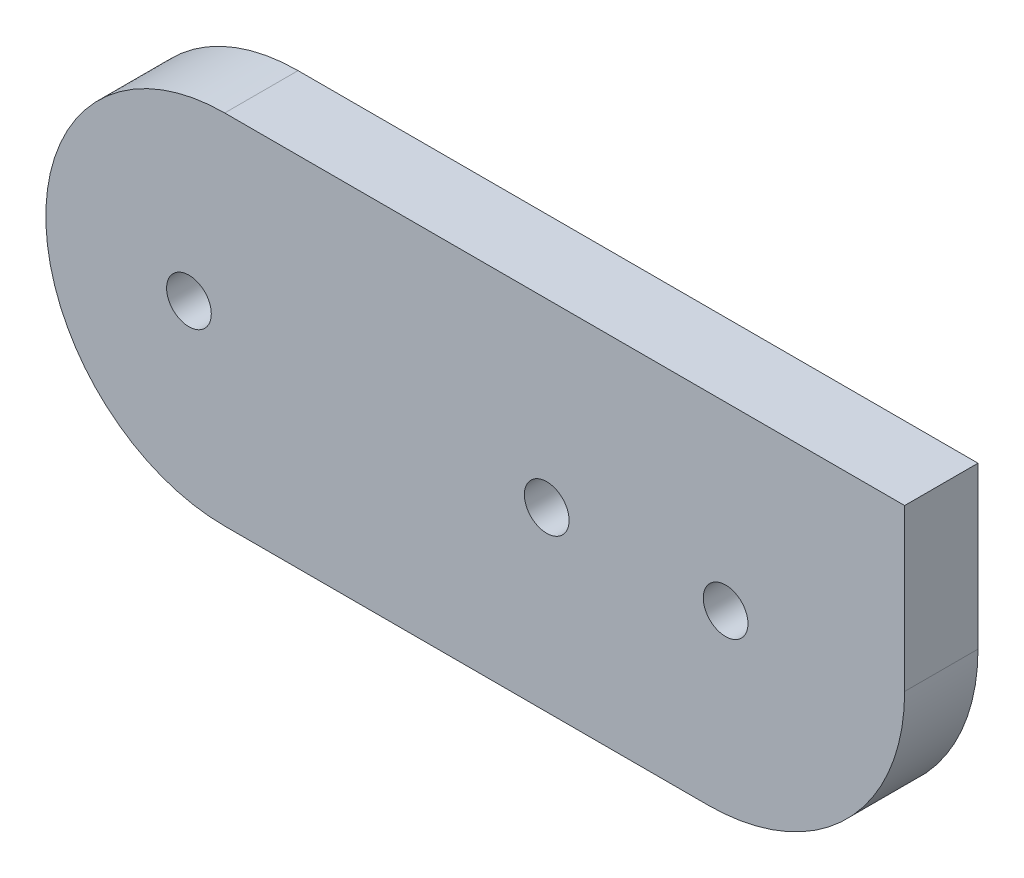
ISO-10303-21;
HEADER;
FILE_DESCRIPTION(('STEP AP214'),'2;1');
FILE_NAME('part.step','',(''),(''),'','','');
FILE_SCHEMA(('AUTOMOTIVE_DESIGN { 1 0 10303 214 1 1 1 1 }'));
ENDSEC;
DATA;
#1=APPLICATION_CONTEXT('core data for automotive mechanical design processes');
#2=APPLICATION_PROTOCOL_DEFINITION('international standard','automotive_design',2000,#1);
#3=PRODUCT_CONTEXT('',#1,'mechanical');
#4=PRODUCT('Part','Part','',(#3));
#5=PRODUCT_RELATED_PRODUCT_CATEGORY('part','',(#4));
#6=PRODUCT_DEFINITION_FORMATION('','',#4);
#7=PRODUCT_DEFINITION_CONTEXT('part definition',#1,'design');
#8=PRODUCT_DEFINITION('design','',#6,#7);
#9=PRODUCT_DEFINITION_SHAPE('','',#8);
#10=(LENGTH_UNIT() NAMED_UNIT(*) SI_UNIT(.MILLI.,.METRE.));
#11=(NAMED_UNIT(*) PLANE_ANGLE_UNIT() SI_UNIT($,.RADIAN.));
#12=(NAMED_UNIT(*) SI_UNIT($,.STERADIAN.) SOLID_ANGLE_UNIT());
#13=UNCERTAINTY_MEASURE_WITH_UNIT(LENGTH_MEASURE(1.E-05),#10,'distance_accuracy_value','');
#14=(GEOMETRIC_REPRESENTATION_CONTEXT(3) GLOBAL_UNCERTAINTY_ASSIGNED_CONTEXT((#13)) GLOBAL_UNIT_ASSIGNED_CONTEXT((#10,
#11,#12)) REPRESENTATION_CONTEXT('',''));
#15=CARTESIAN_POINT('',(0.,0.,0.));
#16=DIRECTION('',(0.,0.,1.));
#17=DIRECTION('',(1.,0.,0.));
#18=AXIS2_PLACEMENT_3D('',#15,#16,#17);
#19=CARTESIAN_POINT('',(0.,-12.,4.1));
#20=DIRECTION('',(0.,1.,0.));
#21=DIRECTION('',(0.,0.,1.));
#22=AXIS2_PLACEMENT_3D('',#19,#20,#21);
#23=PLANE('',#22);
#24=DIRECTION('',(1.,0.,0.));
#25=VECTOR('',#24,1.);
#26=CARTESIAN_POINT('',(0.,-12.,0.));
#27=LINE('',#26,#25);
#28=CARTESIAN_POINT('',(0.,-12.,0.));
#29=VERTEX_POINT('',#28);
#30=CARTESIAN_POINT('',(27.008621711179,-12.,0.));
#31=VERTEX_POINT('',#30);
#32=EDGE_CURVE('E118',#29,#31,#27,.T.);
#33=ORIENTED_EDGE('',*,*,#32,.T.);
#34=DIRECTION('',(0.,0.,-1.));
#35=VECTOR('',#34,1.);
#36=CARTESIAN_POINT('',(27.008621711179,-12.,4.1));
#37=LINE('',#36,#35);
#38=CARTESIAN_POINT('',(27.008621711179,-12.,4.1));
#39=VERTEX_POINT('',#38);
#40=EDGE_CURVE('E40',#31,#39,#37,.F.);
#41=ORIENTED_EDGE('',*,*,#40,.T.);
#42=DIRECTION('',(1.,0.,0.));
#43=VECTOR('',#42,1.);
#44=CARTESIAN_POINT('',(0.,-12.,4.1));
#45=LINE('',#44,#43);
#46=CARTESIAN_POINT('',(0.,-12.,4.1));
#47=VERTEX_POINT('',#46);
#48=EDGE_CURVE('E81',#47,#39,#45,.T.);
#49=ORIENTED_EDGE('',*,*,#48,.F.);
#50=DIRECTION('',(0.,0.,-1.));
#51=VECTOR('',#50,1.);
#52=CARTESIAN_POINT('',(0.,-12.,4.1));
#53=LINE('',#52,#51);
#54=EDGE_CURVE('E92',#47,#29,#53,.T.);
#55=ORIENTED_EDGE('',*,*,#54,.T.);
#56=EDGE_LOOP('',(#33,#41,#49,#55));
#57=FACE_BOUND('',#56,.T.);
#58=ADVANCED_FACE('F32',(#57),#23,.F.);
#59=CARTESIAN_POINT('',(38.008621711179,-12.,4.1));
#60=DIRECTION('',(-1.,0.,0.));
#61=DIRECTION('',(0.,0.,1.));
#62=AXIS2_PLACEMENT_3D('',#59,#60,#61);
#63=PLANE('',#62);
#64=DIRECTION('',(0.,1.,0.));
#65=VECTOR('',#64,1.);
#66=CARTESIAN_POINT('',(38.008621711179,-12.,4.1));
#67=LINE('',#66,#65);
#68=CARTESIAN_POINT('',(38.008621711179,-0.999999999999997,4.1));
#69=VERTEX_POINT('',#68);
#70=CARTESIAN_POINT('',(38.008621711179,8.00000000000005,4.1));
#71=VERTEX_POINT('',#70);
#72=EDGE_CURVE('E93',#69,#71,#67,.T.);
#73=ORIENTED_EDGE('',*,*,#72,.F.);
#74=DIRECTION('',(0.,0.,-1.));
#75=VECTOR('',#74,1.);
#76=CARTESIAN_POINT('',(38.008621711179,-0.999999999999997,4.1));
#77=LINE('',#76,#75);
#78=CARTESIAN_POINT('',(38.008621711179,-0.999999999999997,0.));
#79=VERTEX_POINT('',#78);
#80=EDGE_CURVE('E88',#69,#79,#77,.T.);
#81=ORIENTED_EDGE('',*,*,#80,.T.);
#82=DIRECTION('',(0.,1.,0.));
#83=VECTOR('',#82,1.);
#84=CARTESIAN_POINT('',(38.008621711179,-12.,0.));
#85=LINE('',#84,#83);
#86=CARTESIAN_POINT('',(38.008621711179,8.00000000000005,0.));
#87=VERTEX_POINT('',#86);
#88=EDGE_CURVE('E113',#79,#87,#85,.T.);
#89=ORIENTED_EDGE('',*,*,#88,.T.);
#90=DIRECTION('',(0.,0.,-1.));
#91=VECTOR('',#90,1.);
#92=CARTESIAN_POINT('',(38.008621711179,8.00000000000005,4.1));
#93=LINE('',#92,#91);
#94=EDGE_CURVE('E98',#71,#87,#93,.T.);
#95=ORIENTED_EDGE('',*,*,#94,.F.);
#96=EDGE_LOOP('',(#73,#81,#89,#95));
#97=FACE_BOUND('',#96,.T.);
#98=ADVANCED_FACE('F111',(#97),#63,.F.);
#99=CARTESIAN_POINT('',(23.9978941655449,8.00000000000005,4.1));
#100=DIRECTION('',(0.,-1.,0.));
#101=DIRECTION('',(0.,0.,-1.));
#102=AXIS2_PLACEMENT_3D('',#99,#100,#101);
#103=PLANE('',#102);
#104=DIRECTION('',(-1.,0.,0.));
#105=VECTOR('',#104,1.);
#106=CARTESIAN_POINT('',(23.9978941655449,8.00000000000005,0.));
#107=LINE('',#106,#105);
#108=CARTESIAN_POINT('',(0.,8.00000000000005,0.));
#109=VERTEX_POINT('',#108);
#110=EDGE_CURVE('E94',#87,#109,#107,.T.);
#111=ORIENTED_EDGE('',*,*,#110,.T.);
#112=DIRECTION('',(0.,0.,-1.));
#113=VECTOR('',#112,1.);
#114=CARTESIAN_POINT('',(0.,8.00000000000005,4.1));
#115=LINE('',#114,#113);
#116=CARTESIAN_POINT('',(0.,8.00000000000005,4.1));
#117=VERTEX_POINT('',#116);
#118=EDGE_CURVE('E89',#109,#117,#115,.F.);
#119=ORIENTED_EDGE('',*,*,#118,.T.);
#120=DIRECTION('',(-1.,0.,0.));
#121=VECTOR('',#120,1.);
#122=CARTESIAN_POINT('',(38.008621711179,8.00000000000005,4.1));
#123=LINE('',#122,#121);
#124=EDGE_CURVE('E84',#71,#117,#123,.T.);
#125=ORIENTED_EDGE('',*,*,#124,.F.);
#126=ORIENTED_EDGE('',*,*,#94,.T.);
#127=EDGE_LOOP('',(#111,#119,#125,#126));
#128=FACE_BOUND('',#127,.T.);
#129=ADVANCED_FACE('F154',(#128),#103,.F.);
#130=CARTESIAN_POINT('',(0.,0.,4.1));
#131=DIRECTION('',(0.,0.,1.));
#132=DIRECTION('',(1.,0.,0.));
#133=AXIS2_PLACEMENT_3D('',#130,#131,#132);
#134=PLANE('',#133);
#135=CARTESIAN_POINT('',(18.,-2.09999999999997,4.1));
#136=DIRECTION('',(0.,0.,1.));
#137=DIRECTION('',(1.,0.,0.));
#138=AXIS2_PLACEMENT_3D('',#135,#136,#137);
#139=CIRCLE('',#138,1.25);
#140=CARTESIAN_POINT('',(19.25,-2.09999999999997,4.1));
#141=VERTEX_POINT('',#140);
#142=EDGE_CURVE('E137',#141,#141,#139,.T.);
#143=ORIENTED_EDGE('',*,*,#142,.F.);
#144=EDGE_LOOP('',(#143));
#145=FACE_BOUND('',#144,.T.);
#146=CARTESIAN_POINT('',(28.,-2.09999999999996,4.1));
#147=DIRECTION('',(0.,0.,1.));
#148=DIRECTION('',(1.,0.,0.));
#149=AXIS2_PLACEMENT_3D('',#146,#147,#148);
#150=CIRCLE('',#149,1.25);
#151=CARTESIAN_POINT('',(29.25,-2.09999999999996,4.1));
#152=VERTEX_POINT('',#151);
#153=EDGE_CURVE('E131',#152,#152,#150,.T.);
#154=ORIENTED_EDGE('',*,*,#153,.F.);
#155=EDGE_LOOP('',(#154));
#156=FACE_BOUND('',#155,.T.);
#157=CARTESIAN_POINT('',(-2.,-2.09999999999997,4.1));
#158=DIRECTION('',(0.,0.,1.));
#159=DIRECTION('',(1.,0.,0.));
#160=AXIS2_PLACEMENT_3D('',#157,#158,#159);
#161=CIRCLE('',#160,1.25);
#162=CARTESIAN_POINT('',(-0.750000000000001,-2.09999999999997,4.1));
#163=VERTEX_POINT('',#162);
#164=EDGE_CURVE('E125',#163,#163,#161,.T.);
#165=ORIENTED_EDGE('',*,*,#164,.F.);
#166=EDGE_LOOP('',(#165));
#167=FACE_BOUND('',#166,.T.);
#168=ORIENTED_EDGE('',*,*,#48,.T.);
#169=CARTESIAN_POINT('',(27.008621711179,-0.999999999999997,4.1));
#170=DIRECTION('',(0.,0.,1.));
#171=DIRECTION('',(1.,0.,0.));
#172=AXIS2_PLACEMENT_3D('',#169,#170,#171);
#173=CIRCLE('',#172,11.);
#174=EDGE_CURVE('E11',#39,#69,#173,.T.);
#175=ORIENTED_EDGE('',*,*,#174,.T.);
#176=ORIENTED_EDGE('',*,*,#72,.T.);
#177=ORIENTED_EDGE('',*,*,#124,.T.);
#178=CARTESIAN_POINT('',(0.,-1.99999999999998,4.1));
#179=DIRECTION('',(0.,0.,1.));
#180=DIRECTION('',(1.,0.,0.));
#181=AXIS2_PLACEMENT_3D('',#178,#179,#180);
#182=CIRCLE('',#181,10.);
#183=EDGE_CURVE('E79',#117,#47,#182,.T.);
#184=ORIENTED_EDGE('',*,*,#183,.T.);
#185=EDGE_LOOP('',(#168,#175,#176,#177,#184));
#186=FACE_BOUND('',#185,.T.);
#187=ADVANCED_FACE('F80',(#145,#156,#167,#186),#134,.T.);
#188=CARTESIAN_POINT('',(0.,0.,0.));
#189=DIRECTION('',(0.,0.,1.));
#190=DIRECTION('',(1.,0.,0.));
#191=AXIS2_PLACEMENT_3D('',#188,#189,#190);
#192=PLANE('',#191);
#193=CARTESIAN_POINT('',(18.,-2.09999999999997,0.));
#194=DIRECTION('',(0.,0.,1.));
#195=DIRECTION('',(1.,0.,0.));
#196=AXIS2_PLACEMENT_3D('',#193,#194,#195);
#197=CIRCLE('',#196,1.25);
#198=CARTESIAN_POINT('',(19.25,-2.09999999999997,0.));
#199=VERTEX_POINT('',#198);
#200=EDGE_CURVE('E134',#199,#199,#197,.T.);
#201=ORIENTED_EDGE('',*,*,#200,.T.);
#202=EDGE_LOOP('',(#201));
#203=FACE_BOUND('',#202,.T.);
#204=CARTESIAN_POINT('',(28.,-2.09999999999996,0.));
#205=DIRECTION('',(0.,0.,1.));
#206=DIRECTION('',(1.,0.,0.));
#207=AXIS2_PLACEMENT_3D('',#204,#205,#206);
#208=CIRCLE('',#207,1.25);
#209=CARTESIAN_POINT('',(29.25,-2.09999999999996,0.));
#210=VERTEX_POINT('',#209);
#211=EDGE_CURVE('E128',#210,#210,#208,.T.);
#212=ORIENTED_EDGE('',*,*,#211,.T.);
#213=EDGE_LOOP('',(#212));
#214=FACE_BOUND('',#213,.T.);
#215=CARTESIAN_POINT('',(-2.,-2.09999999999997,0.));
#216=DIRECTION('',(0.,0.,1.));
#217=DIRECTION('',(1.,0.,0.));
#218=AXIS2_PLACEMENT_3D('',#215,#216,#217);
#219=CIRCLE('',#218,1.25);
#220=CARTESIAN_POINT('',(-0.750000000000001,-2.09999999999997,0.));
#221=VERTEX_POINT('',#220);
#222=EDGE_CURVE('E120',#221,#221,#219,.T.);
#223=ORIENTED_EDGE('',*,*,#222,.T.);
#224=EDGE_LOOP('',(#223));
#225=FACE_BOUND('',#224,.T.);
#226=ORIENTED_EDGE('',*,*,#88,.F.);
#227=CARTESIAN_POINT('',(27.008621711179,-0.999999999999997,0.));
#228=DIRECTION('',(0.,0.,1.));
#229=DIRECTION('',(1.,0.,0.));
#230=AXIS2_PLACEMENT_3D('',#227,#228,#229);
#231=CIRCLE('',#230,11.);
#232=EDGE_CURVE('E54',#79,#31,#231,.F.);
#233=ORIENTED_EDGE('',*,*,#232,.T.);
#234=ORIENTED_EDGE('',*,*,#32,.F.);
#235=CARTESIAN_POINT('',(0.,-1.99999999999998,0.));
#236=DIRECTION('',(0.,0.,1.));
#237=DIRECTION('',(1.,0.,0.));
#238=AXIS2_PLACEMENT_3D('',#235,#236,#237);
#239=CIRCLE('',#238,10.);
#240=EDGE_CURVE('E97',#29,#109,#239,.F.);
#241=ORIENTED_EDGE('',*,*,#240,.T.);
#242=ORIENTED_EDGE('',*,*,#110,.F.);
#243=EDGE_LOOP('',(#226,#233,#234,#241,#242));
#244=FACE_BOUND('',#243,.T.);
#245=ADVANCED_FACE('F116',(#203,#214,#225,#244),#192,.F.);
#246=CARTESIAN_POINT('',(-2.,-2.09999999999997,0.));
#247=DIRECTION('',(0.,0.,1.));
#248=DIRECTION('',(1.,0.,0.));
#249=AXIS2_PLACEMENT_3D('',#246,#247,#248);
#250=CYLINDRICAL_SURFACE('',#249,1.25);
#251=ORIENTED_EDGE('',*,*,#222,.F.);
#252=EDGE_LOOP('',(#251));
#253=FACE_BOUND('',#252,.T.);
#254=ORIENTED_EDGE('',*,*,#164,.T.);
#255=EDGE_LOOP('',(#254));
#256=FACE_BOUND('',#255,.T.);
#257=ADVANCED_FACE('F160',(#253,#256),#250,.F.);
#258=CARTESIAN_POINT('',(28.,-2.09999999999996,0.));
#259=DIRECTION('',(0.,0.,1.));
#260=DIRECTION('',(1.,0.,0.));
#261=AXIS2_PLACEMENT_3D('',#258,#259,#260);
#262=CYLINDRICAL_SURFACE('',#261,1.25);
#263=ORIENTED_EDGE('',*,*,#211,.F.);
#264=EDGE_LOOP('',(#263));
#265=FACE_BOUND('',#264,.T.);
#266=ORIENTED_EDGE('',*,*,#153,.T.);
#267=EDGE_LOOP('',(#266));
#268=FACE_BOUND('',#267,.T.);
#269=ADVANCED_FACE('F148',(#265,#268),#262,.F.);
#270=CARTESIAN_POINT('',(18.,-2.09999999999997,0.));
#271=DIRECTION('',(0.,0.,1.));
#272=DIRECTION('',(1.,0.,0.));
#273=AXIS2_PLACEMENT_3D('',#270,#271,#272);
#274=CYLINDRICAL_SURFACE('',#273,1.25);
#275=ORIENTED_EDGE('',*,*,#200,.F.);
#276=EDGE_LOOP('',(#275));
#277=FACE_BOUND('',#276,.T.);
#278=ORIENTED_EDGE('',*,*,#142,.T.);
#279=EDGE_LOOP('',(#278));
#280=FACE_BOUND('',#279,.T.);
#281=ADVANCED_FACE('F145',(#277,#280),#274,.F.);
#282=CARTESIAN_POINT('',(0.,-1.99999999999998,4.1));
#283=DIRECTION('',(0.,0.,-1.));
#284=DIRECTION('',(-1.,0.,0.));
#285=AXIS2_PLACEMENT_3D('',#282,#283,#284);
#286=CYLINDRICAL_SURFACE('',#285,10.);
#287=ORIENTED_EDGE('',*,*,#183,.F.);
#288=ORIENTED_EDGE('',*,*,#118,.F.);
#289=ORIENTED_EDGE('',*,*,#240,.F.);
#290=ORIENTED_EDGE('',*,*,#54,.F.);
#291=EDGE_LOOP('',(#287,#288,#289,#290));
#292=FACE_BOUND('',#291,.T.);
#293=ADVANCED_FACE('F96',(#292),#286,.T.);
#294=CARTESIAN_POINT('',(27.008621711179,-0.999999999999997,4.1));
#295=DIRECTION('',(0.,0.,-1.));
#296=DIRECTION('',(-1.,0.,0.));
#297=AXIS2_PLACEMENT_3D('',#294,#295,#296);
#298=CYLINDRICAL_SURFACE('',#297,11.);
#299=ORIENTED_EDGE('',*,*,#174,.F.);
#300=ORIENTED_EDGE('',*,*,#40,.F.);
#301=ORIENTED_EDGE('',*,*,#232,.F.);
#302=ORIENTED_EDGE('',*,*,#80,.F.);
#303=EDGE_LOOP('',(#299,#300,#301,#302));
#304=FACE_BOUND('',#303,.T.);
#305=ADVANCED_FACE('F34',(#304),#298,.T.);
#306=CLOSED_SHELL('',(#58,#98,#129,#187,#245,#257,#269,#281,#293,#305));
#307=MANIFOLD_SOLID_BREP('B2',#306);
#308=ADVANCED_BREP_SHAPE_REPRESENTATION('',(#18,#307),#14);
#309=SHAPE_DEFINITION_REPRESENTATION(#9,#308);
ENDSEC;
END-ISO-10303-21;
